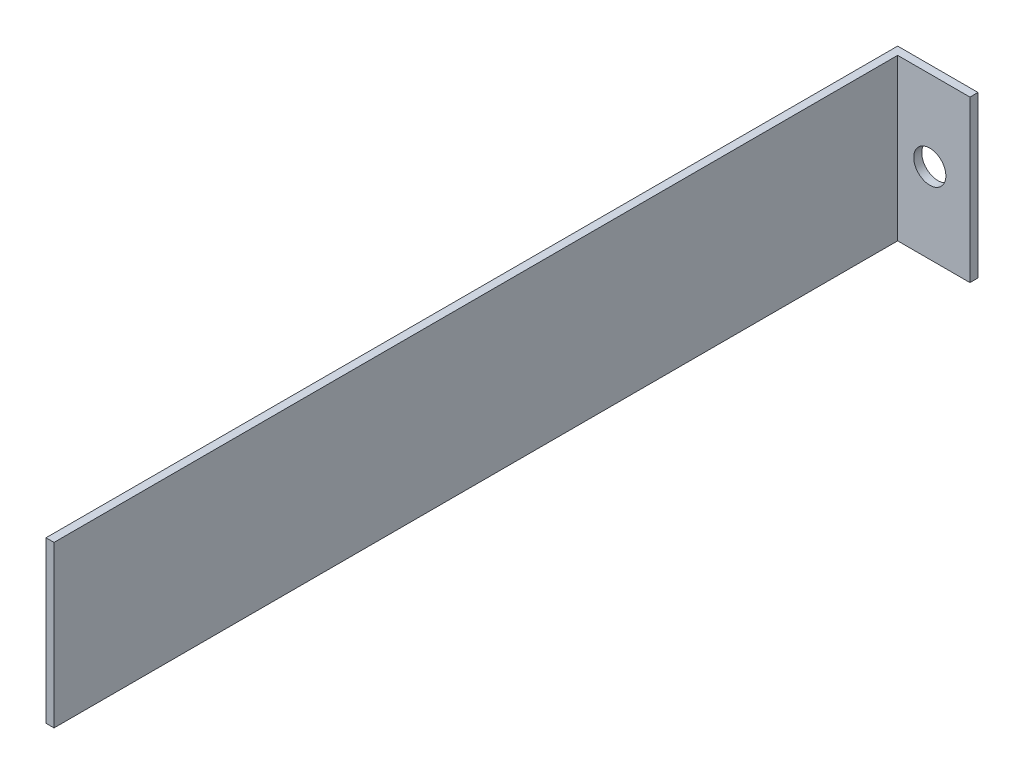
ISO-10303-21;
HEADER;
FILE_DESCRIPTION(('STEP AP214'),'2;1');
FILE_NAME('part.step','',(''),(''),'','','');
FILE_SCHEMA(('AUTOMOTIVE_DESIGN { 1 0 10303 214 1 1 1 1 }'));
ENDSEC;
DATA;
#1=APPLICATION_CONTEXT('core data for automotive mechanical design processes');
#2=APPLICATION_PROTOCOL_DEFINITION('international standard','automotive_design',2000,#1);
#3=PRODUCT_CONTEXT('',#1,'mechanical');
#4=PRODUCT('Part','Part','',(#3));
#5=PRODUCT_RELATED_PRODUCT_CATEGORY('part','',(#4));
#6=PRODUCT_DEFINITION_FORMATION('','',#4);
#7=PRODUCT_DEFINITION_CONTEXT('part definition',#1,'design');
#8=PRODUCT_DEFINITION('design','',#6,#7);
#9=PRODUCT_DEFINITION_SHAPE('','',#8);
#10=(LENGTH_UNIT() NAMED_UNIT(*) SI_UNIT(.MILLI.,.METRE.));
#11=(NAMED_UNIT(*) PLANE_ANGLE_UNIT() SI_UNIT($,.RADIAN.));
#12=(NAMED_UNIT(*) SI_UNIT($,.STERADIAN.) SOLID_ANGLE_UNIT());
#13=UNCERTAINTY_MEASURE_WITH_UNIT(LENGTH_MEASURE(1.E-05),#10,'distance_accuracy_value','');
#14=(GEOMETRIC_REPRESENTATION_CONTEXT(3) GLOBAL_UNCERTAINTY_ASSIGNED_CONTEXT((#13)) GLOBAL_UNIT_ASSIGNED_CONTEXT((#10,
#11,#12)) REPRESENTATION_CONTEXT('',''));
#15=CARTESIAN_POINT('',(0.,0.,0.));
#16=DIRECTION('',(0.,0.,1.));
#17=DIRECTION('',(1.,0.,0.));
#18=AXIS2_PLACEMENT_3D('',#15,#16,#17);
#19=CARTESIAN_POINT('',(0.,0.,2.));
#20=DIRECTION('',(0.,0.,-1.));
#21=DIRECTION('',(-1.,0.,0.));
#22=AXIS2_PLACEMENT_3D('',#19,#20,#21);
#23=PLANE('',#22);
#24=CARTESIAN_POINT('',(-27.117483574834,5.83796559802931,2.));
#25=DIRECTION('',(0.,0.,1.));
#26=DIRECTION('',(1.,0.,0.));
#27=AXIS2_PLACEMENT_3D('',#24,#25,#26);
#28=CIRCLE('',#27,4.);
#29=CARTESIAN_POINT('',(-23.117483574834,5.83796559802931,2.));
#30=VERTEX_POINT('',#29);
#31=EDGE_CURVE('E102',#30,#30,#28,.T.);
#32=ORIENTED_EDGE('',*,*,#31,.F.);
#33=EDGE_LOOP('',(#32));
#34=FACE_BOUND('',#33,.T.);
#35=DIRECTION('',(0.,1.,0.));
#36=VECTOR('',#35,1.);
#37=CARTESIAN_POINT('',(-35.117483574834,25.8379655980293,2.));
#38=LINE('',#37,#36);
#39=CARTESIAN_POINT('',(-35.117483574834,-14.1620344019707,2.));
#40=VERTEX_POINT('',#39);
#41=CARTESIAN_POINT('',(-35.117483574834,25.8379655980293,2.));
#42=VERTEX_POINT('',#41);
#43=EDGE_CURVE('E50',#40,#42,#38,.T.);
#44=ORIENTED_EDGE('',*,*,#43,.F.);
#45=DIRECTION('',(1.,0.,0.));
#46=VECTOR('',#45,1.);
#47=CARTESIAN_POINT('',(-17.117483574834,-14.1620344019707,2.));
#48=LINE('',#47,#46);
#49=CARTESIAN_POINT('',(-17.117483574834,-14.1620344019707,2.));
#50=VERTEX_POINT('',#49);
#51=EDGE_CURVE('E87',#40,#50,#48,.T.);
#52=ORIENTED_EDGE('',*,*,#51,.T.);
#53=DIRECTION('',(0.,1.,0.));
#54=VECTOR('',#53,1.);
#55=CARTESIAN_POINT('',(-17.117483574834,25.8379655980293,2.));
#56=LINE('',#55,#54);
#57=CARTESIAN_POINT('',(-17.117483574834,25.8379655980293,2.));
#58=VERTEX_POINT('',#57);
#59=EDGE_CURVE('E56',#50,#58,#56,.T.);
#60=ORIENTED_EDGE('',*,*,#59,.T.);
#61=DIRECTION('',(-1.,0.,0.));
#62=VECTOR('',#61,1.);
#63=CARTESIAN_POINT('',(-37.117483574834,25.8379655980293,2.));
#64=LINE('',#63,#62);
#65=EDGE_CURVE('E97',#58,#42,#64,.T.);
#66=ORIENTED_EDGE('',*,*,#65,.T.);
#67=EDGE_LOOP('',(#44,#52,#60,#66));
#68=FACE_BOUND('',#67,.T.);
#69=ADVANCED_FACE('F35',(#34,#68),#23,.F.);
#70=CARTESIAN_POINT('',(0.,0.,0.));
#71=DIRECTION('',(0.,0.,-1.));
#72=DIRECTION('',(-1.,0.,0.));
#73=AXIS2_PLACEMENT_3D('',#70,#71,#72);
#74=PLANE('',#73);
#75=DIRECTION('',(0.,-1.,0.));
#76=VECTOR('',#75,1.);
#77=CARTESIAN_POINT('',(-37.117483574834,-14.1620344019707,0.));
#78=LINE('',#77,#76);
#79=CARTESIAN_POINT('',(-37.117483574834,25.8379655980293,0.));
#80=VERTEX_POINT('',#79);
#81=CARTESIAN_POINT('',(-37.117483574834,-14.1620344019707,0.));
#82=VERTEX_POINT('',#81);
#83=EDGE_CURVE('E94',#80,#82,#78,.T.);
#84=ORIENTED_EDGE('',*,*,#83,.F.);
#85=DIRECTION('',(-1.,0.,0.));
#86=VECTOR('',#85,1.);
#87=CARTESIAN_POINT('',(-37.117483574834,25.8379655980293,0.));
#88=LINE('',#87,#86);
#89=CARTESIAN_POINT('',(-17.117483574834,25.8379655980293,0.));
#90=VERTEX_POINT('',#89);
#91=EDGE_CURVE('E76',#90,#80,#88,.T.);
#92=ORIENTED_EDGE('',*,*,#91,.F.);
#93=DIRECTION('',(0.,1.,0.));
#94=VECTOR('',#93,1.);
#95=CARTESIAN_POINT('',(-17.117483574834,25.8379655980293,0.));
#96=LINE('',#95,#94);
#97=CARTESIAN_POINT('',(-17.117483574834,-14.1620344019707,0.));
#98=VERTEX_POINT('',#97);
#99=EDGE_CURVE('E88',#98,#90,#96,.T.);
#100=ORIENTED_EDGE('',*,*,#99,.F.);
#101=DIRECTION('',(1.,0.,0.));
#102=VECTOR('',#101,1.);
#103=CARTESIAN_POINT('',(-17.117483574834,-14.1620344019707,0.));
#104=LINE('',#103,#102);
#105=EDGE_CURVE('E101',#82,#98,#104,.T.);
#106=ORIENTED_EDGE('',*,*,#105,.F.);
#107=EDGE_LOOP('',(#84,#92,#100,#106));
#108=FACE_BOUND('',#107,.T.);
#109=CARTESIAN_POINT('',(-27.117483574834,5.83796559802931,0.));
#110=DIRECTION('',(0.,0.,1.));
#111=DIRECTION('',(1.,0.,0.));
#112=AXIS2_PLACEMENT_3D('',#109,#110,#111);
#113=CIRCLE('',#112,4.);
#114=CARTESIAN_POINT('',(-23.117483574834,5.83796559802931,0.));
#115=VERTEX_POINT('',#114);
#116=EDGE_CURVE('E106',#115,#115,#113,.T.);
#117=ORIENTED_EDGE('',*,*,#116,.T.);
#118=EDGE_LOOP('',(#117));
#119=FACE_BOUND('',#118,.T.);
#120=ADVANCED_FACE('F99',(#108,#119),#74,.T.);
#121=CARTESIAN_POINT('',(-37.117483574834,-14.1620344019707,2.));
#122=DIRECTION('',(1.,0.,0.));
#123=DIRECTION('',(0.,0.,-1.));
#124=AXIS2_PLACEMENT_3D('',#121,#122,#123);
#125=PLANE('',#124);
#126=ORIENTED_EDGE('',*,*,#83,.T.);
#127=DIRECTION('',(0.,0.,-1.));
#128=VECTOR('',#127,1.);
#129=CARTESIAN_POINT('',(-37.117483574834,-14.1620344019707,2.));
#130=LINE('',#129,#128);
#131=CARTESIAN_POINT('',(-37.117483574834,-14.1620344019707,212.));
#132=VERTEX_POINT('',#131);
#133=EDGE_CURVE('E11',#132,#82,#130,.T.);
#134=ORIENTED_EDGE('',*,*,#133,.F.);
#135=DIRECTION('',(0.,-1.,0.));
#136=VECTOR('',#135,1.);
#137=CARTESIAN_POINT('',(-37.117483574834,-14.1620344019707,212.));
#138=LINE('',#137,#136);
#139=CARTESIAN_POINT('',(-37.117483574834,25.8379655980293,212.));
#140=VERTEX_POINT('',#139);
#141=EDGE_CURVE('E96',#140,#132,#138,.T.);
#142=ORIENTED_EDGE('',*,*,#141,.F.);
#143=DIRECTION('',(0.,0.,-1.));
#144=VECTOR('',#143,1.);
#145=CARTESIAN_POINT('',(-37.117483574834,25.8379655980293,2.));
#146=LINE('',#145,#144);
#147=EDGE_CURVE('E80',#140,#80,#146,.T.);
#148=ORIENTED_EDGE('',*,*,#147,.T.);
#149=EDGE_LOOP('',(#126,#134,#142,#148));
#150=FACE_BOUND('',#149,.T.);
#151=ADVANCED_FACE('F37',(#150),#125,.F.);
#152=CARTESIAN_POINT('',(-17.117483574834,-14.1620344019707,2.));
#153=DIRECTION('',(0.,1.,0.));
#154=DIRECTION('',(0.,0.,1.));
#155=AXIS2_PLACEMENT_3D('',#152,#153,#154);
#156=PLANE('',#155);
#157=ORIENTED_EDGE('',*,*,#105,.T.);
#158=DIRECTION('',(0.,0.,-1.));
#159=VECTOR('',#158,1.);
#160=CARTESIAN_POINT('',(-17.117483574834,-14.1620344019707,2.));
#161=LINE('',#160,#159);
#162=EDGE_CURVE('E43',#50,#98,#161,.T.);
#163=ORIENTED_EDGE('',*,*,#162,.F.);
#164=ORIENTED_EDGE('',*,*,#51,.F.);
#165=DIRECTION('',(0.,0.,-1.));
#166=VECTOR('',#165,1.);
#167=CARTESIAN_POINT('',(-35.117483574834,-14.1620344019707,212.));
#168=LINE('',#167,#166);
#169=CARTESIAN_POINT('',(-35.117483574834,-14.1620344019707,212.));
#170=VERTEX_POINT('',#169);
#171=EDGE_CURVE('E143',#170,#40,#168,.T.);
#172=ORIENTED_EDGE('',*,*,#171,.F.);
#173=DIRECTION('',(1.,0.,0.));
#174=VECTOR('',#173,1.);
#175=CARTESIAN_POINT('',(-35.117483574834,-14.1620344019707,212.));
#176=LINE('',#175,#174);
#177=EDGE_CURVE('E123',#132,#170,#176,.T.);
#178=ORIENTED_EDGE('',*,*,#177,.F.);
#179=ORIENTED_EDGE('',*,*,#133,.T.);
#180=EDGE_LOOP('',(#157,#163,#164,#172,#178,#179));
#181=FACE_BOUND('',#180,.T.);
#182=ADVANCED_FACE('F117',(#181),#156,.F.);
#183=CARTESIAN_POINT('',(-17.117483574834,25.8379655980293,2.));
#184=DIRECTION('',(-1.,0.,0.));
#185=DIRECTION('',(0.,0.,1.));
#186=AXIS2_PLACEMENT_3D('',#183,#184,#185);
#187=PLANE('',#186);
#188=ORIENTED_EDGE('',*,*,#99,.T.);
#189=DIRECTION('',(0.,0.,-1.));
#190=VECTOR('',#189,1.);
#191=CARTESIAN_POINT('',(-17.117483574834,25.8379655980293,2.));
#192=LINE('',#191,#190);
#193=EDGE_CURVE('E83',#58,#90,#192,.T.);
#194=ORIENTED_EDGE('',*,*,#193,.F.);
#195=ORIENTED_EDGE('',*,*,#59,.F.);
#196=ORIENTED_EDGE('',*,*,#162,.T.);
#197=EDGE_LOOP('',(#188,#194,#195,#196));
#198=FACE_BOUND('',#197,.T.);
#199=ADVANCED_FACE('F115',(#198),#187,.F.);
#200=CARTESIAN_POINT('',(-37.117483574834,25.8379655980293,2.));
#201=DIRECTION('',(0.,-1.,0.));
#202=DIRECTION('',(0.,0.,-1.));
#203=AXIS2_PLACEMENT_3D('',#200,#201,#202);
#204=PLANE('',#203);
#205=ORIENTED_EDGE('',*,*,#91,.T.);
#206=ORIENTED_EDGE('',*,*,#147,.F.);
#207=DIRECTION('',(-1.,0.,0.));
#208=VECTOR('',#207,1.);
#209=CARTESIAN_POINT('',(-37.117483574834,25.8379655980293,212.));
#210=LINE('',#209,#208);
#211=CARTESIAN_POINT('',(-35.117483574834,25.8379655980293,212.));
#212=VERTEX_POINT('',#211);
#213=EDGE_CURVE('E137',#212,#140,#210,.T.);
#214=ORIENTED_EDGE('',*,*,#213,.F.);
#215=DIRECTION('',(0.,0.,-1.));
#216=VECTOR('',#215,1.);
#217=CARTESIAN_POINT('',(-35.117483574834,25.8379655980293,212.));
#218=LINE('',#217,#216);
#219=EDGE_CURVE('E141',#212,#42,#218,.T.);
#220=ORIENTED_EDGE('',*,*,#219,.T.);
#221=ORIENTED_EDGE('',*,*,#65,.F.);
#222=ORIENTED_EDGE('',*,*,#193,.T.);
#223=EDGE_LOOP('',(#205,#206,#214,#220,#221,#222));
#224=FACE_BOUND('',#223,.T.);
#225=ADVANCED_FACE('F78',(#224),#204,.F.);
#226=CARTESIAN_POINT('',(-27.117483574834,5.83796559802931,2.));
#227=DIRECTION('',(0.,0.,-1.));
#228=DIRECTION('',(-1.,0.,0.));
#229=AXIS2_PLACEMENT_3D('',#226,#227,#228);
#230=CYLINDRICAL_SURFACE('',#229,4.);
#231=ORIENTED_EDGE('',*,*,#31,.T.);
#232=EDGE_LOOP('',(#231));
#233=FACE_BOUND('',#232,.T.);
#234=ORIENTED_EDGE('',*,*,#116,.F.);
#235=EDGE_LOOP('',(#234));
#236=FACE_BOUND('',#235,.T.);
#237=ADVANCED_FACE('F161',(#233,#236),#230,.F.);
#238=CARTESIAN_POINT('',(-35.117483574834,25.8379655980293,212.));
#239=DIRECTION('',(-1.,0.,0.));
#240=DIRECTION('',(0.,0.,1.));
#241=AXIS2_PLACEMENT_3D('',#238,#239,#240);
#242=PLANE('',#241);
#243=ORIENTED_EDGE('',*,*,#43,.T.);
#244=ORIENTED_EDGE('',*,*,#219,.F.);
#245=DIRECTION('',(0.,1.,0.));
#246=VECTOR('',#245,1.);
#247=CARTESIAN_POINT('',(-35.117483574834,25.8379655980293,212.));
#248=LINE('',#247,#246);
#249=EDGE_CURVE('E134',#170,#212,#248,.T.);
#250=ORIENTED_EDGE('',*,*,#249,.F.);
#251=ORIENTED_EDGE('',*,*,#171,.T.);
#252=EDGE_LOOP('',(#243,#244,#250,#251));
#253=FACE_BOUND('',#252,.T.);
#254=ADVANCED_FACE('F142',(#253),#242,.F.);
#255=CARTESIAN_POINT('',(0.,0.,212.));
#256=DIRECTION('',(0.,0.,-1.));
#257=DIRECTION('',(-1.,0.,0.));
#258=AXIS2_PLACEMENT_3D('',#255,#256,#257);
#259=PLANE('',#258);
#260=ORIENTED_EDGE('',*,*,#141,.T.);
#261=ORIENTED_EDGE('',*,*,#177,.T.);
#262=ORIENTED_EDGE('',*,*,#249,.T.);
#263=ORIENTED_EDGE('',*,*,#213,.T.);
#264=EDGE_LOOP('',(#260,#261,#262,#263));
#265=FACE_BOUND('',#264,.T.);
#266=ADVANCED_FACE('F136',(#265),#259,.F.);
#267=CLOSED_SHELL('',(#69,#120,#151,#182,#199,#225,#237,#254,#266));
#268=MANIFOLD_SOLID_BREP('B2',#267);
#269=ADVANCED_BREP_SHAPE_REPRESENTATION('',(#18,#268),#14);
#270=SHAPE_DEFINITION_REPRESENTATION(#9,#269);
ENDSEC;
END-ISO-10303-21;
